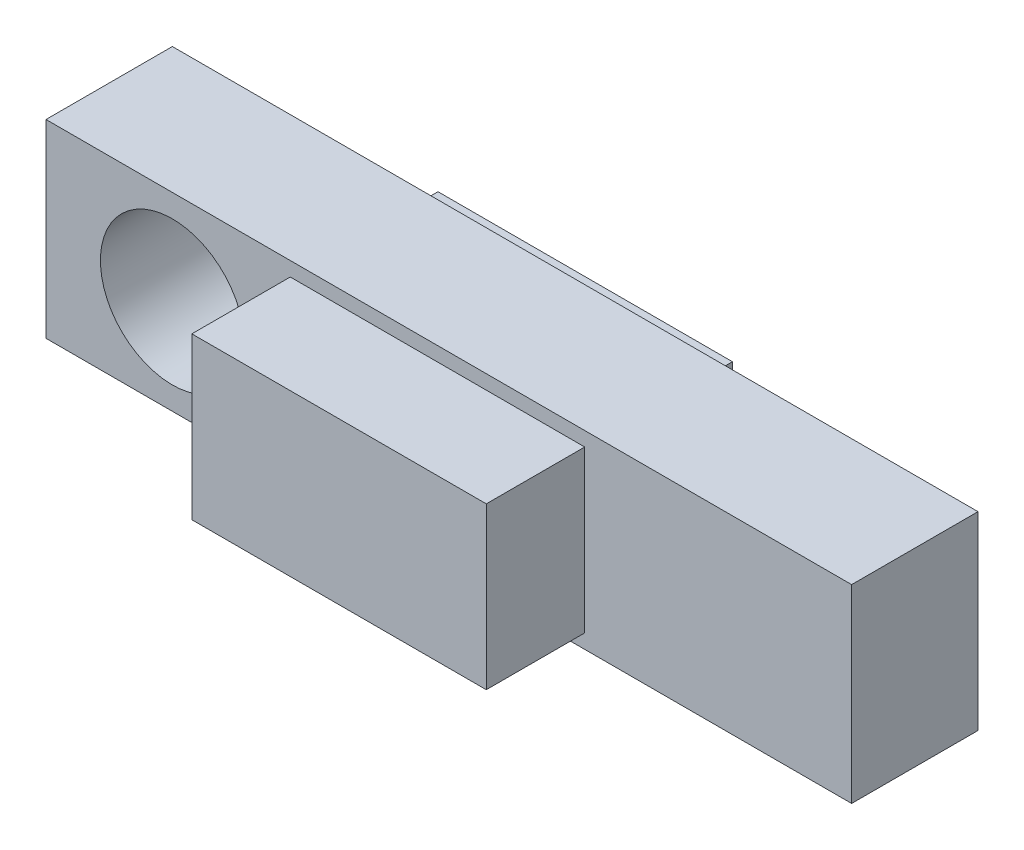
ISO-10303-21;
HEADER;
FILE_DESCRIPTION(('STEP AP214'),'2;1');
FILE_NAME('part.step','',(''),(''),'','','');
FILE_SCHEMA(('AUTOMOTIVE_DESIGN { 1 0 10303 214 1 1 1 1 }'));
ENDSEC;
DATA;
#1=APPLICATION_CONTEXT('core data for automotive mechanical design processes');
#2=APPLICATION_PROTOCOL_DEFINITION('international standard','automotive_design',2000,#1);
#3=PRODUCT_CONTEXT('',#1,'mechanical');
#4=PRODUCT('Part','Part','',(#3));
#5=PRODUCT_RELATED_PRODUCT_CATEGORY('part','',(#4));
#6=PRODUCT_DEFINITION_FORMATION('','',#4);
#7=PRODUCT_DEFINITION_CONTEXT('part definition',#1,'design');
#8=PRODUCT_DEFINITION('design','',#6,#7);
#9=PRODUCT_DEFINITION_SHAPE('','',#8);
#10=(LENGTH_UNIT() NAMED_UNIT(*) SI_UNIT(.MILLI.,.METRE.));
#11=(NAMED_UNIT(*) PLANE_ANGLE_UNIT() SI_UNIT($,.RADIAN.));
#12=(NAMED_UNIT(*) SI_UNIT($,.STERADIAN.) SOLID_ANGLE_UNIT());
#13=UNCERTAINTY_MEASURE_WITH_UNIT(LENGTH_MEASURE(1.E-05),#10,'distance_accuracy_value','');
#14=(GEOMETRIC_REPRESENTATION_CONTEXT(3) GLOBAL_UNCERTAINTY_ASSIGNED_CONTEXT((#13)) GLOBAL_UNIT_ASSIGNED_CONTEXT((#10,
#11,#12)) REPRESENTATION_CONTEXT('',''));
#15=CARTESIAN_POINT('',(0.,0.,0.));
#16=DIRECTION('',(0.,0.,1.));
#17=DIRECTION('',(1.,0.,0.));
#18=AXIS2_PLACEMENT_3D('',#15,#16,#17);
#19=CARTESIAN_POINT('',(0.,0.,0.));
#20=DIRECTION('',(0.,0.,-1.));
#21=DIRECTION('',(-1.,0.,0.));
#22=AXIS2_PLACEMENT_3D('',#19,#20,#21);
#23=PLANE('',#22);
#24=CARTESIAN_POINT('',(25.4,0.,0.));
#25=DIRECTION('',(0.,0.,-1.));
#26=DIRECTION('',(-1.,0.,0.));
#27=AXIS2_PLACEMENT_3D('',#24,#25,#26);
#28=CIRCLE('',#27,14.4653);
#29=CARTESIAN_POINT('',(10.9347,0.,0.));
#30=VERTEX_POINT('',#29);
#31=EDGE_CURVE('E287',#30,#30,#28,.T.);
#32=ORIENTED_EDGE('',*,*,#31,.F.);
#33=EDGE_LOOP('',(#32));
#34=FACE_BOUND('',#33,.T.);
#35=DIRECTION('',(0.,-1.,0.));
#36=VECTOR('',#35,1.);
#37=CARTESIAN_POINT('',(0.,-19.05,0.));
#38=LINE('',#37,#36);
#39=CARTESIAN_POINT('',(0.,19.05,0.));
#40=VERTEX_POINT('',#39);
#41=CARTESIAN_POINT('',(0.,-19.05,0.));
#42=VERTEX_POINT('',#41);
#43=EDGE_CURVE('E180',#40,#42,#38,.T.);
#44=ORIENTED_EDGE('',*,*,#43,.F.);
#45=DIRECTION('',(-1.,0.,0.));
#46=VECTOR('',#45,1.);
#47=CARTESIAN_POINT('',(0.,19.05,0.));
#48=LINE('',#47,#46);
#49=CARTESIAN_POINT('',(161.925,19.05,0.));
#50=VERTEX_POINT('',#49);
#51=EDGE_CURVE('E185',#50,#40,#48,.T.);
#52=ORIENTED_EDGE('',*,*,#51,.F.);
#53=DIRECTION('',(0.,1.,0.));
#54=VECTOR('',#53,1.);
#55=CARTESIAN_POINT('',(161.925,-19.05,0.));
#56=LINE('',#55,#54);
#57=CARTESIAN_POINT('',(161.925,-19.05,0.));
#58=VERTEX_POINT('',#57);
#59=EDGE_CURVE('E196',#58,#50,#56,.T.);
#60=ORIENTED_EDGE('',*,*,#59,.F.);
#61=DIRECTION('',(1.,0.,0.));
#62=VECTOR('',#61,1.);
#63=CARTESIAN_POINT('',(0.,-19.05,0.));
#64=LINE('',#63,#62);
#65=EDGE_CURVE('E194',#42,#58,#64,.T.);
#66=ORIENTED_EDGE('',*,*,#65,.F.);
#67=EDGE_LOOP('',(#44,#52,#60,#66));
#68=FACE_BOUND('',#67,.T.);
#69=DIRECTION('',(1.,0.,0.));
#70=VECTOR('',#69,1.);
#71=CARTESIAN_POINT('',(49.0982,16.1798,0.));
#72=LINE('',#71,#70);
#73=CARTESIAN_POINT('',(49.0982,16.1798,0.));
#74=VERTEX_POINT('',#73);
#75=CARTESIAN_POINT('',(108.2802,16.1798,0.));
#76=VERTEX_POINT('',#75);
#77=EDGE_CURVE('E298',#74,#76,#72,.T.);
#78=ORIENTED_EDGE('',*,*,#77,.F.);
#79=DIRECTION('',(0.,1.,0.));
#80=VECTOR('',#79,1.);
#81=CARTESIAN_POINT('',(49.0982,16.1798,0.));
#82=LINE('',#81,#80);
#83=CARTESIAN_POINT('',(49.0982,-16.1798,0.));
#84=VERTEX_POINT('',#83);
#85=EDGE_CURVE('E144',#84,#74,#82,.T.);
#86=ORIENTED_EDGE('',*,*,#85,.F.);
#87=DIRECTION('',(-1.,0.,0.));
#88=VECTOR('',#87,1.);
#89=CARTESIAN_POINT('',(49.0982,-16.1798,0.));
#90=LINE('',#89,#88);
#91=CARTESIAN_POINT('',(108.2802,-16.1798,0.));
#92=VERTEX_POINT('',#91);
#93=EDGE_CURVE('E140',#92,#84,#90,.T.);
#94=ORIENTED_EDGE('',*,*,#93,.F.);
#95=DIRECTION('',(0.,-1.,0.));
#96=VECTOR('',#95,1.);
#97=CARTESIAN_POINT('',(108.2802,16.1798,0.));
#98=LINE('',#97,#96);
#99=EDGE_CURVE('E300',#76,#92,#98,.T.);
#100=ORIENTED_EDGE('',*,*,#99,.F.);
#101=EDGE_LOOP('',(#78,#86,#94,#100));
#102=FACE_BOUND('',#101,.T.);
#103=ADVANCED_FACE('F32',(#34,#68,#102),#23,.T.);
#104=CARTESIAN_POINT('',(0.,0.,25.4));
#105=DIRECTION('',(0.,0.,-1.));
#106=DIRECTION('',(-1.,0.,0.));
#107=AXIS2_PLACEMENT_3D('',#104,#105,#106);
#108=PLANE('',#107);
#109=CARTESIAN_POINT('',(25.4,0.,25.4));
#110=DIRECTION('',(0.,0.,1.));
#111=DIRECTION('',(1.,0.,0.));
#112=AXIS2_PLACEMENT_3D('',#109,#110,#111);
#113=CIRCLE('',#112,14.4653);
#114=CARTESIAN_POINT('',(39.8653,0.,25.4));
#115=VERTEX_POINT('',#114);
#116=EDGE_CURVE('E290',#115,#115,#113,.T.);
#117=ORIENTED_EDGE('',*,*,#116,.F.);
#118=EDGE_LOOP('',(#117));
#119=FACE_BOUND('',#118,.T.);
#120=DIRECTION('',(0.,-1.,0.));
#121=VECTOR('',#120,1.);
#122=CARTESIAN_POINT('',(0.,-19.05,25.4));
#123=LINE('',#122,#121);
#124=CARTESIAN_POINT('',(0.,19.05,25.4));
#125=VERTEX_POINT('',#124);
#126=CARTESIAN_POINT('',(0.,-19.05,25.4));
#127=VERTEX_POINT('',#126);
#128=EDGE_CURVE('E181',#125,#127,#123,.T.);
#129=ORIENTED_EDGE('',*,*,#128,.T.);
#130=DIRECTION('',(1.,0.,0.));
#131=VECTOR('',#130,1.);
#132=CARTESIAN_POINT('',(0.,-19.05,25.4));
#133=LINE('',#132,#131);
#134=CARTESIAN_POINT('',(161.925,-19.05,25.4));
#135=VERTEX_POINT('',#134);
#136=EDGE_CURVE('E184',#127,#135,#133,.T.);
#137=ORIENTED_EDGE('',*,*,#136,.T.);
#138=DIRECTION('',(0.,1.,0.));
#139=VECTOR('',#138,1.);
#140=CARTESIAN_POINT('',(161.925,-19.05,25.4));
#141=LINE('',#140,#139);
#142=CARTESIAN_POINT('',(161.925,19.05,25.4));
#143=VERTEX_POINT('',#142);
#144=EDGE_CURVE('E187',#135,#143,#141,.T.);
#145=ORIENTED_EDGE('',*,*,#144,.T.);
#146=DIRECTION('',(-1.,0.,0.));
#147=VECTOR('',#146,1.);
#148=CARTESIAN_POINT('',(0.,19.05,25.4));
#149=LINE('',#148,#147);
#150=EDGE_CURVE('E189',#143,#125,#149,.T.);
#151=ORIENTED_EDGE('',*,*,#150,.T.);
#152=EDGE_LOOP('',(#129,#137,#145,#151));
#153=FACE_BOUND('',#152,.T.);
#154=DIRECTION('',(0.,-1.,0.));
#155=VECTOR('',#154,1.);
#156=CARTESIAN_POINT('',(49.0982,-16.1798,25.4));
#157=LINE('',#156,#155);
#158=CARTESIAN_POINT('',(49.0982,16.1798,25.4));
#159=VERTEX_POINT('',#158);
#160=CARTESIAN_POINT('',(49.0982,-16.1798,25.4));
#161=VERTEX_POINT('',#160);
#162=EDGE_CURVE('E146',#159,#161,#157,.T.);
#163=ORIENTED_EDGE('',*,*,#162,.F.);
#164=DIRECTION('',(-1.,0.,0.));
#165=VECTOR('',#164,1.);
#166=CARTESIAN_POINT('',(49.0982,16.1798,25.4));
#167=LINE('',#166,#165);
#168=CARTESIAN_POINT('',(108.2802,16.1798,25.4));
#169=VERTEX_POINT('',#168);
#170=EDGE_CURVE('E157',#169,#159,#167,.T.);
#171=ORIENTED_EDGE('',*,*,#170,.F.);
#172=DIRECTION('',(0.,1.,0.));
#173=VECTOR('',#172,1.);
#174=CARTESIAN_POINT('',(108.2802,-16.1798,25.4));
#175=LINE('',#174,#173);
#176=CARTESIAN_POINT('',(108.2802,-16.1798,25.4));
#177=VERTEX_POINT('',#176);
#178=EDGE_CURVE('E165',#177,#169,#175,.T.);
#179=ORIENTED_EDGE('',*,*,#178,.F.);
#180=DIRECTION('',(1.,0.,0.));
#181=VECTOR('',#180,1.);
#182=CARTESIAN_POINT('',(49.0982,-16.1798,25.4));
#183=LINE('',#182,#181);
#184=EDGE_CURVE('E55',#161,#177,#183,.T.);
#185=ORIENTED_EDGE('',*,*,#184,.F.);
#186=EDGE_LOOP('',(#163,#171,#179,#185));
#187=FACE_BOUND('',#186,.T.);
#188=ADVANCED_FACE('F223',(#119,#153,#187),#108,.F.);
#189=CARTESIAN_POINT('',(0.,-19.05,25.4));
#190=DIRECTION('',(1.,0.,0.));
#191=DIRECTION('',(0.,0.,-1.));
#192=AXIS2_PLACEMENT_3D('',#189,#190,#191);
#193=PLANE('',#192);
#194=ORIENTED_EDGE('',*,*,#43,.T.);
#195=DIRECTION('',(0.,0.,-1.));
#196=VECTOR('',#195,1.);
#197=CARTESIAN_POINT('',(0.,-19.05,25.4));
#198=LINE('',#197,#196);
#199=EDGE_CURVE('E11',#127,#42,#198,.T.);
#200=ORIENTED_EDGE('',*,*,#199,.F.);
#201=ORIENTED_EDGE('',*,*,#128,.F.);
#202=DIRECTION('',(0.,0.,-1.));
#203=VECTOR('',#202,1.);
#204=CARTESIAN_POINT('',(0.,19.05,25.4));
#205=LINE('',#204,#203);
#206=EDGE_CURVE('E191',#125,#40,#205,.T.);
#207=ORIENTED_EDGE('',*,*,#206,.T.);
#208=EDGE_LOOP('',(#194,#200,#201,#207));
#209=FACE_BOUND('',#208,.T.);
#210=ADVANCED_FACE('F34',(#209),#193,.F.);
#211=CARTESIAN_POINT('',(0.,-19.05,25.4));
#212=DIRECTION('',(0.,1.,0.));
#213=DIRECTION('',(0.,0.,1.));
#214=AXIS2_PLACEMENT_3D('',#211,#212,#213);
#215=PLANE('',#214);
#216=ORIENTED_EDGE('',*,*,#65,.T.);
#217=DIRECTION('',(0.,0.,-1.));
#218=VECTOR('',#217,1.);
#219=CARTESIAN_POINT('',(161.925,-19.05,25.4));
#220=LINE('',#219,#218);
#221=EDGE_CURVE('E40',#135,#58,#220,.T.);
#222=ORIENTED_EDGE('',*,*,#221,.F.);
#223=ORIENTED_EDGE('',*,*,#136,.F.);
#224=ORIENTED_EDGE('',*,*,#199,.T.);
#225=EDGE_LOOP('',(#216,#222,#223,#224));
#226=FACE_BOUND('',#225,.T.);
#227=ADVANCED_FACE('F224',(#226),#215,.F.);
#228=CARTESIAN_POINT('',(161.925,-19.05,25.4));
#229=DIRECTION('',(-1.,0.,0.));
#230=DIRECTION('',(0.,0.,1.));
#231=AXIS2_PLACEMENT_3D('',#228,#229,#230);
#232=PLANE('',#231);
#233=ORIENTED_EDGE('',*,*,#59,.T.);
#234=DIRECTION('',(0.,0.,-1.));
#235=VECTOR('',#234,1.);
#236=CARTESIAN_POINT('',(161.925,19.05,25.4));
#237=LINE('',#236,#235);
#238=EDGE_CURVE('E201',#143,#50,#237,.T.);
#239=ORIENTED_EDGE('',*,*,#238,.F.);
#240=ORIENTED_EDGE('',*,*,#144,.F.);
#241=ORIENTED_EDGE('',*,*,#221,.T.);
#242=EDGE_LOOP('',(#233,#239,#240,#241));
#243=FACE_BOUND('',#242,.T.);
#244=ADVANCED_FACE('F208',(#243),#232,.F.);
#245=CARTESIAN_POINT('',(0.,19.05,25.4));
#246=DIRECTION('',(0.,-1.,0.));
#247=DIRECTION('',(0.,0.,-1.));
#248=AXIS2_PLACEMENT_3D('',#245,#246,#247);
#249=PLANE('',#248);
#250=ORIENTED_EDGE('',*,*,#51,.T.);
#251=ORIENTED_EDGE('',*,*,#206,.F.);
#252=ORIENTED_EDGE('',*,*,#150,.F.);
#253=ORIENTED_EDGE('',*,*,#238,.T.);
#254=EDGE_LOOP('',(#250,#251,#252,#253));
#255=FACE_BOUND('',#254,.T.);
#256=ADVANCED_FACE('F217',(#255),#249,.F.);
#257=CARTESIAN_POINT('',(49.0982,-16.1798,45.1866));
#258=DIRECTION('',(1.,0.,0.));
#259=DIRECTION('',(0.,0.,-1.));
#260=AXIS2_PLACEMENT_3D('',#257,#258,#259);
#261=PLANE('',#260);
#262=ORIENTED_EDGE('',*,*,#162,.T.);
#263=DIRECTION('',(0.,0.,-1.));
#264=VECTOR('',#263,1.);
#265=CARTESIAN_POINT('',(49.0982,-16.1798,45.1866));
#266=LINE('',#265,#264);
#267=CARTESIAN_POINT('',(49.0982,-16.1798,45.1866));
#268=VERTEX_POINT('',#267);
#269=EDGE_CURVE('E178',#268,#161,#266,.T.);
#270=ORIENTED_EDGE('',*,*,#269,.F.);
#271=DIRECTION('',(0.,-1.,0.));
#272=VECTOR('',#271,1.);
#273=CARTESIAN_POINT('',(49.0982,-16.1798,45.1866));
#274=LINE('',#273,#272);
#275=CARTESIAN_POINT('',(49.0982,16.1798,45.1866));
#276=VERTEX_POINT('',#275);
#277=EDGE_CURVE('E153',#276,#268,#274,.T.);
#278=ORIENTED_EDGE('',*,*,#277,.F.);
#279=DIRECTION('',(0.,0.,-1.));
#280=VECTOR('',#279,1.);
#281=CARTESIAN_POINT('',(49.0982,16.1798,45.1866));
#282=LINE('',#281,#280);
#283=EDGE_CURVE('E162',#276,#159,#282,.T.);
#284=ORIENTED_EDGE('',*,*,#283,.T.);
#285=EDGE_LOOP('',(#262,#270,#278,#284));
#286=FACE_BOUND('',#285,.T.);
#287=ADVANCED_FACE('F243',(#286),#261,.F.);
#288=CARTESIAN_POINT('',(49.0982,-16.1798,45.1866));
#289=DIRECTION('',(0.,1.,0.));
#290=DIRECTION('',(0.,0.,1.));
#291=AXIS2_PLACEMENT_3D('',#288,#289,#290);
#292=PLANE('',#291);
#293=ORIENTED_EDGE('',*,*,#184,.T.);
#294=DIRECTION('',(0.,0.,-1.));
#295=VECTOR('',#294,1.);
#296=CARTESIAN_POINT('',(108.2802,-16.1798,45.1866));
#297=LINE('',#296,#295);
#298=CARTESIAN_POINT('',(108.2802,-16.1798,45.1866));
#299=VERTEX_POINT('',#298);
#300=EDGE_CURVE('E175',#299,#177,#297,.T.);
#301=ORIENTED_EDGE('',*,*,#300,.F.);
#302=DIRECTION('',(1.,0.,0.));
#303=VECTOR('',#302,1.);
#304=CARTESIAN_POINT('',(49.0982,-16.1798,45.1866));
#305=LINE('',#304,#303);
#306=EDGE_CURVE('E156',#268,#299,#305,.T.);
#307=ORIENTED_EDGE('',*,*,#306,.F.);
#308=ORIENTED_EDGE('',*,*,#269,.T.);
#309=EDGE_LOOP('',(#293,#301,#307,#308));
#310=FACE_BOUND('',#309,.T.);
#311=ADVANCED_FACE('F247',(#310),#292,.F.);
#312=CARTESIAN_POINT('',(108.2802,-16.1798,45.1866));
#313=DIRECTION('',(-1.,0.,0.));
#314=DIRECTION('',(0.,0.,1.));
#315=AXIS2_PLACEMENT_3D('',#312,#313,#314);
#316=PLANE('',#315);
#317=ORIENTED_EDGE('',*,*,#178,.T.);
#318=DIRECTION('',(0.,0.,-1.));
#319=VECTOR('',#318,1.);
#320=CARTESIAN_POINT('',(108.2802,16.1798,45.1866));
#321=LINE('',#320,#319);
#322=CARTESIAN_POINT('',(108.2802,16.1798,45.1866));
#323=VERTEX_POINT('',#322);
#324=EDGE_CURVE('E172',#323,#169,#321,.T.);
#325=ORIENTED_EDGE('',*,*,#324,.F.);
#326=DIRECTION('',(0.,1.,0.));
#327=VECTOR('',#326,1.);
#328=CARTESIAN_POINT('',(108.2802,-16.1798,45.1866));
#329=LINE('',#328,#327);
#330=EDGE_CURVE('E159',#299,#323,#329,.T.);
#331=ORIENTED_EDGE('',*,*,#330,.F.);
#332=ORIENTED_EDGE('',*,*,#300,.T.);
#333=EDGE_LOOP('',(#317,#325,#331,#332));
#334=FACE_BOUND('',#333,.T.);
#335=ADVANCED_FACE('F252',(#334),#316,.F.);
#336=CARTESIAN_POINT('',(49.0982,16.1798,45.1866));
#337=DIRECTION('',(0.,-1.,0.));
#338=DIRECTION('',(0.,0.,-1.));
#339=AXIS2_PLACEMENT_3D('',#336,#337,#338);
#340=PLANE('',#339);
#341=ORIENTED_EDGE('',*,*,#170,.T.);
#342=ORIENTED_EDGE('',*,*,#283,.F.);
#343=DIRECTION('',(-1.,0.,0.));
#344=VECTOR('',#343,1.);
#345=CARTESIAN_POINT('',(49.0982,16.1798,45.1866));
#346=LINE('',#345,#344);
#347=EDGE_CURVE('E161',#323,#276,#346,.T.);
#348=ORIENTED_EDGE('',*,*,#347,.F.);
#349=ORIENTED_EDGE('',*,*,#324,.T.);
#350=EDGE_LOOP('',(#341,#342,#348,#349));
#351=FACE_BOUND('',#350,.T.);
#352=ADVANCED_FACE('F258',(#351),#340,.F.);
#353=CARTESIAN_POINT('',(0.,0.,45.1866));
#354=DIRECTION('',(0.,0.,-1.));
#355=DIRECTION('',(-1.,0.,0.));
#356=AXIS2_PLACEMENT_3D('',#353,#354,#355);
#357=PLANE('',#356);
#358=ORIENTED_EDGE('',*,*,#277,.T.);
#359=ORIENTED_EDGE('',*,*,#306,.T.);
#360=ORIENTED_EDGE('',*,*,#330,.T.);
#361=ORIENTED_EDGE('',*,*,#347,.T.);
#362=EDGE_LOOP('',(#358,#359,#360,#361));
#363=FACE_BOUND('',#362,.T.);
#364=ADVANCED_FACE('F262',(#363),#357,.F.);
#365=CARTESIAN_POINT('',(49.0982,16.1798,-4.2926));
#366=DIRECTION('',(1.,0.,0.));
#367=DIRECTION('',(0.,0.,-1.));
#368=AXIS2_PLACEMENT_3D('',#365,#366,#367);
#369=PLANE('',#368);
#370=ORIENTED_EDGE('',*,*,#85,.T.);
#371=DIRECTION('',(0.,0.,1.));
#372=VECTOR('',#371,1.);
#373=CARTESIAN_POINT('',(49.0982,16.1798,-4.2926));
#374=LINE('',#373,#372);
#375=CARTESIAN_POINT('',(49.0982,16.1798,-4.2926));
#376=VERTEX_POINT('',#375);
#377=EDGE_CURVE('E125',#376,#74,#374,.T.);
#378=ORIENTED_EDGE('',*,*,#377,.F.);
#379=DIRECTION('',(0.,1.,0.));
#380=VECTOR('',#379,1.);
#381=CARTESIAN_POINT('',(49.0982,16.1798,-4.2926));
#382=LINE('',#381,#380);
#383=CARTESIAN_POINT('',(49.0982,-16.1798,-4.2926));
#384=VERTEX_POINT('',#383);
#385=EDGE_CURVE('E132',#384,#376,#382,.T.);
#386=ORIENTED_EDGE('',*,*,#385,.F.);
#387=DIRECTION('',(0.,0.,1.));
#388=VECTOR('',#387,1.);
#389=CARTESIAN_POINT('',(49.0982,-16.1798,-4.2926));
#390=LINE('',#389,#388);
#391=EDGE_CURVE('E296',#384,#84,#390,.T.);
#392=ORIENTED_EDGE('',*,*,#391,.T.);
#393=EDGE_LOOP('',(#370,#378,#386,#392));
#394=FACE_BOUND('',#393,.T.);
#395=ADVANCED_FACE('F142',(#394),#369,.F.);
#396=CARTESIAN_POINT('',(49.0982,16.1798,-4.2926));
#397=DIRECTION('',(0.,-1.,0.));
#398=DIRECTION('',(0.,0.,-1.));
#399=AXIS2_PLACEMENT_3D('',#396,#397,#398);
#400=PLANE('',#399);
#401=ORIENTED_EDGE('',*,*,#77,.T.);
#402=DIRECTION('',(0.,0.,1.));
#403=VECTOR('',#402,1.);
#404=CARTESIAN_POINT('',(108.2802,16.1798,-4.2926));
#405=LINE('',#404,#403);
#406=CARTESIAN_POINT('',(108.2802,16.1798,-4.2926));
#407=VERTEX_POINT('',#406);
#408=EDGE_CURVE('E128',#407,#76,#405,.T.);
#409=ORIENTED_EDGE('',*,*,#408,.F.);
#410=DIRECTION('',(1.,0.,0.));
#411=VECTOR('',#410,1.);
#412=CARTESIAN_POINT('',(49.0982,16.1798,-4.2926));
#413=LINE('',#412,#411);
#414=EDGE_CURVE('E121',#376,#407,#413,.T.);
#415=ORIENTED_EDGE('',*,*,#414,.F.);
#416=ORIENTED_EDGE('',*,*,#377,.T.);
#417=EDGE_LOOP('',(#401,#409,#415,#416));
#418=FACE_BOUND('',#417,.T.);
#419=ADVANCED_FACE('F123',(#418),#400,.F.);
#420=CARTESIAN_POINT('',(108.2802,16.1798,-4.2926));
#421=DIRECTION('',(-1.,0.,0.));
#422=DIRECTION('',(0.,0.,1.));
#423=AXIS2_PLACEMENT_3D('',#420,#421,#422);
#424=PLANE('',#423);
#425=ORIENTED_EDGE('',*,*,#99,.T.);
#426=DIRECTION('',(0.,0.,1.));
#427=VECTOR('',#426,1.);
#428=CARTESIAN_POINT('',(108.2802,-16.1798,-4.2926));
#429=LINE('',#428,#427);
#430=CARTESIAN_POINT('',(108.2802,-16.1798,-4.2926));
#431=VERTEX_POINT('',#430);
#432=EDGE_CURVE('E47',#431,#92,#429,.T.);
#433=ORIENTED_EDGE('',*,*,#432,.F.);
#434=DIRECTION('',(0.,-1.,0.));
#435=VECTOR('',#434,1.);
#436=CARTESIAN_POINT('',(108.2802,16.1798,-4.2926));
#437=LINE('',#436,#435);
#438=EDGE_CURVE('E131',#407,#431,#437,.T.);
#439=ORIENTED_EDGE('',*,*,#438,.F.);
#440=ORIENTED_EDGE('',*,*,#408,.T.);
#441=EDGE_LOOP('',(#425,#433,#439,#440));
#442=FACE_BOUND('',#441,.T.);
#443=ADVANCED_FACE('F271',(#442),#424,.F.);
#444=CARTESIAN_POINT('',(49.0982,-16.1798,-4.2926));
#445=DIRECTION('',(0.,1.,0.));
#446=DIRECTION('',(0.,0.,1.));
#447=AXIS2_PLACEMENT_3D('',#444,#445,#446);
#448=PLANE('',#447);
#449=ORIENTED_EDGE('',*,*,#93,.T.);
#450=ORIENTED_EDGE('',*,*,#391,.F.);
#451=DIRECTION('',(-1.,0.,0.));
#452=VECTOR('',#451,1.);
#453=CARTESIAN_POINT('',(49.0982,-16.1798,-4.2926));
#454=LINE('',#453,#452);
#455=EDGE_CURVE('E136',#431,#384,#454,.T.);
#456=ORIENTED_EDGE('',*,*,#455,.F.);
#457=ORIENTED_EDGE('',*,*,#432,.T.);
#458=EDGE_LOOP('',(#449,#450,#456,#457));
#459=FACE_BOUND('',#458,.T.);
#460=ADVANCED_FACE('F274',(#459),#448,.F.);
#461=CARTESIAN_POINT('',(0.,0.,-4.2926));
#462=DIRECTION('',(0.,0.,1.));
#463=DIRECTION('',(1.,0.,0.));
#464=AXIS2_PLACEMENT_3D('',#461,#462,#463);
#465=PLANE('',#464);
#466=ORIENTED_EDGE('',*,*,#385,.T.);
#467=ORIENTED_EDGE('',*,*,#414,.T.);
#468=ORIENTED_EDGE('',*,*,#438,.T.);
#469=ORIENTED_EDGE('',*,*,#455,.T.);
#470=EDGE_LOOP('',(#466,#467,#468,#469));
#471=FACE_BOUND('',#470,.T.);
#472=ADVANCED_FACE('F135',(#471),#465,.F.);
#473=CARTESIAN_POINT('',(25.4,0.,-4.2926));
#474=DIRECTION('',(0.,0.,1.));
#475=DIRECTION('',(1.,0.,0.));
#476=AXIS2_PLACEMENT_3D('',#473,#474,#475);
#477=CYLINDRICAL_SURFACE('',#476,14.4653);
#478=ORIENTED_EDGE('',*,*,#31,.T.);
#479=EDGE_LOOP('',(#478));
#480=FACE_BOUND('',#479,.T.);
#481=ORIENTED_EDGE('',*,*,#116,.T.);
#482=EDGE_LOOP('',(#481));
#483=FACE_BOUND('',#482,.T.);
#484=ADVANCED_FACE('F280',(#480,#483),#477,.F.);
#485=CLOSED_SHELL('',(#103,#188,#210,#227,#244,#256,#287,#311,#335,#352,#364,#395,#419,#443,
#460,#472,#484));
#486=MANIFOLD_SOLID_BREP('B2',#485);
#487=ADVANCED_BREP_SHAPE_REPRESENTATION('',(#18,#486),#14);
#488=SHAPE_DEFINITION_REPRESENTATION(#9,#487);
ENDSEC;
END-ISO-10303-21;
